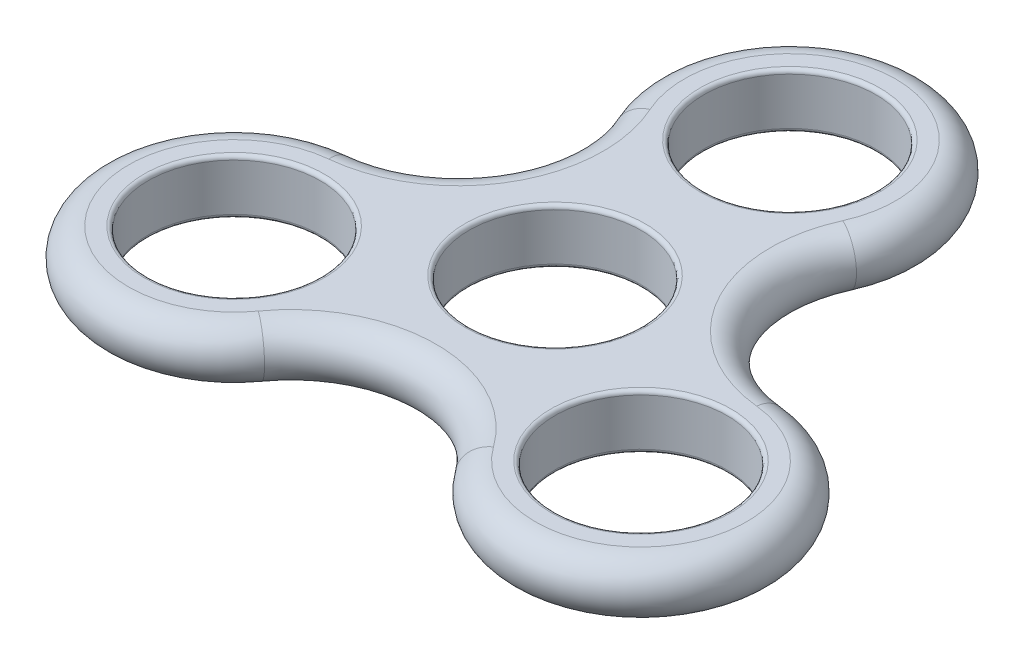
ISO-10303-21;
HEADER;
FILE_DESCRIPTION(('STEP AP214'),'2;1');
FILE_NAME('part.step','',(''),(''),'','','');
FILE_SCHEMA(('AUTOMOTIVE_DESIGN { 1 0 10303 214 1 1 1 1 }'));
ENDSEC;
DATA;
#1=APPLICATION_CONTEXT('core data for automotive mechanical design processes');
#2=APPLICATION_PROTOCOL_DEFINITION('international standard','automotive_design',2000,#1);
#3=PRODUCT_CONTEXT('',#1,'mechanical');
#4=PRODUCT('Part','Part','',(#3));
#5=PRODUCT_RELATED_PRODUCT_CATEGORY('part','',(#4));
#6=PRODUCT_DEFINITION_FORMATION('','',#4);
#7=PRODUCT_DEFINITION_CONTEXT('part definition',#1,'design');
#8=PRODUCT_DEFINITION('design','',#6,#7);
#9=PRODUCT_DEFINITION_SHAPE('','',#8);
#10=(LENGTH_UNIT() NAMED_UNIT(*) SI_UNIT(.MILLI.,.METRE.));
#11=(NAMED_UNIT(*) PLANE_ANGLE_UNIT() SI_UNIT($,.RADIAN.));
#12=(NAMED_UNIT(*) SI_UNIT($,.STERADIAN.) SOLID_ANGLE_UNIT());
#13=UNCERTAINTY_MEASURE_WITH_UNIT(LENGTH_MEASURE(1.E-05),#10,'distance_accuracy_value','');
#14=(GEOMETRIC_REPRESENTATION_CONTEXT(3) GLOBAL_UNCERTAINTY_ASSIGNED_CONTEXT((#13)) GLOBAL_UNIT_ASSIGNED_CONTEXT((#10,
#11,#12)) REPRESENTATION_CONTEXT('',''));
#15=CARTESIAN_POINT('',(0.,0.,0.));
#16=DIRECTION('',(0.,0.,1.));
#17=DIRECTION('',(1.,0.,0.));
#18=AXIS2_PLACEMENT_3D('',#15,#16,#17);
#19=CARTESIAN_POINT('',(0.,3.5,-30.));
#20=DIRECTION('',(0.,1.,0.));
#21=DIRECTION('',(0.,0.,1.));
#22=AXIS2_PLACEMENT_3D('',#19,#20,#21);
#23=TOROIDAL_SURFACE('',#22,13.5,3.5);
#24=CARTESIAN_POINT('',(-12.3057017201798,3.5,-24.4484502007131));
#25=DIRECTION('',(0.411225911058291,0.,0.911533460754063));
#26=DIRECTION('',(0.911533460754063,0.,-0.411225911058291));
#27=AXIS2_PLACEMENT_3D('',#24,#25,#26);
#28=CIRCLE('',#27,3.5);
#29=CARTESIAN_POINT('',(-12.3057017201799,7.,-24.4484502007131));
#30=VERTEX_POINT('',#29);
#31=CARTESIAN_POINT('',(-12.3057017201799,0.,-24.4484502007131));
#32=VERTEX_POINT('',#31);
#33=EDGE_CURVE('E101',#30,#32,#28,.T.);
#34=ORIENTED_EDGE('',*,*,#33,.F.);
#35=CARTESIAN_POINT('',(0.,7.,-30.));
#36=DIRECTION('',(0.,1.,0.));
#37=DIRECTION('',(0.,0.,1.));
#38=AXIS2_PLACEMENT_3D('',#35,#36,#37);
#39=CIRCLE('',#38,13.5);
#40=CARTESIAN_POINT('',(12.3057017201799,7.,-24.4484502007131));
#41=VERTEX_POINT('',#40);
#42=EDGE_CURVE('E109',#41,#30,#39,.T.);
#43=ORIENTED_EDGE('',*,*,#42,.F.);
#44=CARTESIAN_POINT('',(12.3057017201799,3.5,-24.4484502007131));
#45=DIRECTION('',(0.411225911058292,0.,-0.911533460754062));
#46=DIRECTION('',(-0.911533460754062,0.,-0.411225911058293));
#47=AXIS2_PLACEMENT_3D('',#44,#45,#46);
#48=CIRCLE('',#47,3.5);
#49=CARTESIAN_POINT('',(12.3057017201799,0.,-24.4484502007131));
#50=VERTEX_POINT('',#49);
#51=EDGE_CURVE('E91',#41,#50,#48,.T.);
#52=ORIENTED_EDGE('',*,*,#51,.T.);
#53=CARTESIAN_POINT('',(0.,0.,-30.));
#54=DIRECTION('',(0.,1.,0.));
#55=DIRECTION('',(0.,0.,1.));
#56=AXIS2_PLACEMENT_3D('',#53,#54,#55);
#57=CIRCLE('',#56,13.5);
#58=EDGE_CURVE('E125',#32,#50,#57,.F.);
#59=ORIENTED_EDGE('',*,*,#58,.F.);
#60=EDGE_LOOP('',(#34,#43,#52,#59));
#61=FACE_BOUND('',#60,.T.);
#62=ADVANCED_FACE('F37',(#61),#23,.T.);
#63=CARTESIAN_POINT('',(29.16907074413,3.5,-16.8407708461347));
#64=DIRECTION('',(0.,-1.,0.));
#65=DIRECTION('',(0.,0.,-1.));
#66=AXIS2_PLACEMENT_3D('',#63,#64,#65);
#67=TOROIDAL_SURFACE('',#66,18.5,3.5);
#68=ORIENTED_EDGE('',*,*,#51,.F.);
#69=CARTESIAN_POINT('',(29.16907074413,7.,-16.8407708461347));
#70=DIRECTION('',(0.,1.,0.));
#71=DIRECTION('',(0.,0.,1.));
#72=AXIS2_PLACEMENT_3D('',#69,#70,#71);
#73=CIRCLE('',#72,18.5);
#74=CARTESIAN_POINT('',(27.3258298170662,7.,1.56717479928705));
#75=VERTEX_POINT('',#74);
#76=EDGE_CURVE('E94',#75,#41,#73,.F.);
#77=ORIENTED_EDGE('',*,*,#76,.F.);
#78=CARTESIAN_POINT('',(27.3258298170662,3.5,1.56717479928705));
#79=DIRECTION('',(-0.995024088941709,0.,-0.0996346447061538));
#80=DIRECTION('',(-0.0996346447061538,0.,0.995024088941709));
#81=AXIS2_PLACEMENT_3D('',#78,#79,#80);
#82=CIRCLE('',#81,3.5);
#83=CARTESIAN_POINT('',(27.3258298170662,0.,1.56717479928705));
#84=VERTEX_POINT('',#83);
#85=EDGE_CURVE('E102',#75,#84,#82,.T.);
#86=ORIENTED_EDGE('',*,*,#85,.T.);
#87=CARTESIAN_POINT('',(29.16907074413,0.,-16.8407708461347));
#88=DIRECTION('',(0.,1.,0.));
#89=DIRECTION('',(0.,0.,1.));
#90=AXIS2_PLACEMENT_3D('',#87,#88,#89);
#91=CIRCLE('',#90,18.5);
#92=EDGE_CURVE('E96',#50,#84,#91,.T.);
#93=ORIENTED_EDGE('',*,*,#92,.F.);
#94=EDGE_LOOP('',(#68,#77,#86,#93));
#95=FACE_BOUND('',#94,.T.);
#96=ADVANCED_FACE('F93',(#95),#67,.T.);
#97=CARTESIAN_POINT('',(25.9807621135331,3.5,15.0000000000001));
#98=DIRECTION('',(0.,1.,0.));
#99=DIRECTION('',(0.,0.,1.));
#100=AXIS2_PLACEMENT_3D('',#97,#98,#99);
#101=TOROIDAL_SURFACE('',#100,13.5,3.5);
#102=ORIENTED_EDGE('',*,*,#85,.F.);
#103=CARTESIAN_POINT('',(25.9807621135331,7.,15.0000000000001));
#104=DIRECTION('',(0.,1.,0.));
#105=DIRECTION('',(0.,0.,1.));
#106=AXIS2_PLACEMENT_3D('',#103,#104,#105);
#107=CIRCLE('',#106,13.5);
#108=CARTESIAN_POINT('',(15.0201280968863,7.,22.8812754014263));
#109=VERTEX_POINT('',#108);
#110=EDGE_CURVE('E112',#109,#75,#107,.T.);
#111=ORIENTED_EDGE('',*,*,#110,.F.);
#112=CARTESIAN_POINT('',(15.0201280968863,3.5,22.8812754014263));
#113=DIRECTION('',(0.583798177883418,0.,0.811898816047912));
#114=DIRECTION('',(0.811898816047912,0.,-0.583798177883418));
#115=AXIS2_PLACEMENT_3D('',#112,#113,#114);
#116=CIRCLE('',#115,3.5);
#117=CARTESIAN_POINT('',(15.0201280968863,0.,22.8812754014263));
#118=VERTEX_POINT('',#117);
#119=EDGE_CURVE('E142',#109,#118,#116,.T.);
#120=ORIENTED_EDGE('',*,*,#119,.T.);
#121=CARTESIAN_POINT('',(25.9807621135331,0.,15.0000000000001));
#122=DIRECTION('',(0.,1.,0.));
#123=DIRECTION('',(0.,0.,1.));
#124=AXIS2_PLACEMENT_3D('',#121,#122,#123);
#125=CIRCLE('',#124,13.5);
#126=EDGE_CURVE('E128',#84,#118,#125,.F.);
#127=ORIENTED_EDGE('',*,*,#126,.F.);
#128=EDGE_LOOP('',(#102,#111,#120,#127));
#129=FACE_BOUND('',#128,.T.);
#130=ADVANCED_FACE('F206',(#129),#101,.T.);
#131=CARTESIAN_POINT('',(0.,3.5,33.6815416922694));
#132=DIRECTION('',(0.,-1.,0.));
#133=DIRECTION('',(0.,0.,-1.));
#134=AXIS2_PLACEMENT_3D('',#131,#132,#133);
#135=TOROIDAL_SURFACE('',#134,18.5,3.5);
#136=ORIENTED_EDGE('',*,*,#119,.F.);
#137=CARTESIAN_POINT('',(0.,7.,33.6815416922694));
#138=DIRECTION('',(0.,1.,0.));
#139=DIRECTION('',(0.,0.,1.));
#140=AXIS2_PLACEMENT_3D('',#137,#138,#139);
#141=CIRCLE('',#140,18.5);
#142=CARTESIAN_POINT('',(-15.0201280968865,7.,22.8812754014259));
#143=VERTEX_POINT('',#142);
#144=EDGE_CURVE('E118',#143,#109,#141,.F.);
#145=ORIENTED_EDGE('',*,*,#144,.F.);
#146=CARTESIAN_POINT('',(-15.0201280968865,3.5,22.881275401426));
#147=DIRECTION('',(0.583798177883421,0.,-0.81189881604791));
#148=DIRECTION('',(-0.81189881604791,0.,-0.583798177883421));
#149=AXIS2_PLACEMENT_3D('',#146,#147,#148);
#150=CIRCLE('',#149,3.5);
#151=CARTESIAN_POINT('',(-15.0201280968865,0.,22.8812754014259));
#152=VERTEX_POINT('',#151);
#153=EDGE_CURVE('E60',#143,#152,#150,.T.);
#154=ORIENTED_EDGE('',*,*,#153,.T.);
#155=CARTESIAN_POINT('',(0.,0.,33.6815416922694));
#156=DIRECTION('',(0.,1.,0.));
#157=DIRECTION('',(0.,0.,1.));
#158=AXIS2_PLACEMENT_3D('',#155,#156,#157);
#159=CIRCLE('',#158,18.5);
#160=EDGE_CURVE('E131',#118,#152,#159,.T.);
#161=ORIENTED_EDGE('',*,*,#160,.F.);
#162=EDGE_LOOP('',(#136,#145,#154,#161));
#163=FACE_BOUND('',#162,.T.);
#164=ADVANCED_FACE('F279',(#163),#135,.T.);
#165=CARTESIAN_POINT('',(-25.9807621135333,3.5,14.9999999999998));
#166=DIRECTION('',(0.,1.,0.));
#167=DIRECTION('',(0.,0.,1.));
#168=AXIS2_PLACEMENT_3D('',#165,#166,#167);
#169=TOROIDAL_SURFACE('',#168,13.5,3.5);
#170=ORIENTED_EDGE('',*,*,#153,.F.);
#171=CARTESIAN_POINT('',(-25.9807621135333,7.,14.9999999999998));
#172=DIRECTION('',(0.,1.,0.));
#173=DIRECTION('',(0.,0.,1.));
#174=AXIS2_PLACEMENT_3D('',#171,#172,#173);
#175=CIRCLE('',#174,13.5);
#176=CARTESIAN_POINT('',(-27.3258298170663,7.,1.56717479928667));
#177=VERTEX_POINT('',#176);
#178=EDGE_CURVE('E120',#177,#143,#175,.T.);
#179=ORIENTED_EDGE('',*,*,#178,.F.);
#180=CARTESIAN_POINT('',(-27.3258298170663,3.5,1.56717479928667));
#181=DIRECTION('',(-0.99502408894171,0.,0.0996346447061479));
#182=DIRECTION('',(0.0996346447061479,0.,0.99502408894171));
#183=AXIS2_PLACEMENT_3D('',#180,#181,#182);
#184=CIRCLE('',#183,3.5);
#185=CARTESIAN_POINT('',(-27.3258298170663,0.,1.56717479928667));
#186=VERTEX_POINT('',#185);
#187=EDGE_CURVE('E52',#177,#186,#184,.T.);
#188=ORIENTED_EDGE('',*,*,#187,.T.);
#189=CARTESIAN_POINT('',(-25.9807621135333,0.,14.9999999999998));
#190=DIRECTION('',(0.,1.,0.));
#191=DIRECTION('',(0.,0.,1.));
#192=AXIS2_PLACEMENT_3D('',#189,#190,#191);
#193=CIRCLE('',#192,13.5);
#194=EDGE_CURVE('E134',#152,#186,#193,.F.);
#195=ORIENTED_EDGE('',*,*,#194,.F.);
#196=EDGE_LOOP('',(#170,#179,#188,#195));
#197=FACE_BOUND('',#196,.T.);
#198=ADVANCED_FACE('F272',(#197),#169,.T.);
#199=CARTESIAN_POINT('',(-29.16907074413,3.5,-16.8407708461347));
#200=DIRECTION('',(0.,-1.,0.));
#201=DIRECTION('',(0.,0.,-1.));
#202=AXIS2_PLACEMENT_3D('',#199,#200,#201);
#203=TOROIDAL_SURFACE('',#202,18.5,3.5);
#204=CARTESIAN_POINT('',(-29.16907074413,7.,-16.8407708461347));
#205=DIRECTION('',(0.,1.,0.));
#206=DIRECTION('',(0.,0.,1.));
#207=AXIS2_PLACEMENT_3D('',#204,#205,#206);
#208=CIRCLE('',#207,18.5);
#209=EDGE_CURVE('E123',#30,#177,#208,.F.);
#210=ORIENTED_EDGE('',*,*,#209,.F.);
#211=ORIENTED_EDGE('',*,*,#33,.T.);
#212=CARTESIAN_POINT('',(-29.16907074413,0.,-16.8407708461347));
#213=DIRECTION('',(0.,1.,0.));
#214=DIRECTION('',(0.,0.,1.));
#215=AXIS2_PLACEMENT_3D('',#212,#213,#214);
#216=CIRCLE('',#215,18.5);
#217=EDGE_CURVE('E137',#186,#32,#216,.T.);
#218=ORIENTED_EDGE('',*,*,#217,.F.);
#219=ORIENTED_EDGE('',*,*,#187,.F.);
#220=EDGE_LOOP('',(#210,#211,#218,#219));
#221=FACE_BOUND('',#220,.T.);
#222=ADVANCED_FACE('F261',(#221),#203,.T.);
#223=CARTESIAN_POINT('',(25.9807621135331,7.,15.0000000000001));
#224=DIRECTION('',(0.,-1.,0.));
#225=DIRECTION('',(0.,0.,-1.));
#226=AXIS2_PLACEMENT_3D('',#223,#224,#225);
#227=CYLINDRICAL_SURFACE('',#226,11.);
#228=CARTESIAN_POINT('',(25.9807621135331,0.5,15.0000000000001));
#229=DIRECTION('',(0.,1.,0.));
#230=DIRECTION('',(0.,0.,1.));
#231=AXIS2_PLACEMENT_3D('',#228,#229,#230);
#232=CIRCLE('',#231,11.);
#233=CARTESIAN_POINT('',(25.9807621135331,0.5,26.0000000000001));
#234=VERTEX_POINT('',#233);
#235=EDGE_CURVE('E161',#234,#234,#232,.F.);
#236=ORIENTED_EDGE('',*,*,#235,.T.);
#237=EDGE_LOOP('',(#236));
#238=FACE_BOUND('',#237,.T.);
#239=CARTESIAN_POINT('',(25.9807621135331,6.5,15.0000000000001));
#240=DIRECTION('',(0.,1.,0.));
#241=DIRECTION('',(0.,0.,1.));
#242=AXIS2_PLACEMENT_3D('',#239,#240,#241);
#243=CIRCLE('',#242,11.);
#244=CARTESIAN_POINT('',(25.9807621135331,6.5,26.0000000000001));
#245=VERTEX_POINT('',#244);
#246=EDGE_CURVE('E158',#245,#245,#243,.T.);
#247=ORIENTED_EDGE('',*,*,#246,.T.);
#248=EDGE_LOOP('',(#247));
#249=FACE_BOUND('',#248,.T.);
#250=ADVANCED_FACE('F258',(#238,#249),#227,.F.);
#251=CARTESIAN_POINT('',(0.,7.,0.));
#252=DIRECTION('',(0.,-1.,0.));
#253=DIRECTION('',(0.,0.,-1.));
#254=AXIS2_PLACEMENT_3D('',#251,#252,#253);
#255=CYLINDRICAL_SURFACE('',#254,11.);
#256=CARTESIAN_POINT('',(0.,0.5,0.));
#257=DIRECTION('',(0.,1.,0.));
#258=DIRECTION('',(0.,0.,1.));
#259=AXIS2_PLACEMENT_3D('',#256,#257,#258);
#260=CIRCLE('',#259,11.);
#261=CARTESIAN_POINT('',(0.,0.5,11.));
#262=VERTEX_POINT('',#261);
#263=EDGE_CURVE('E179',#262,#262,#260,.F.);
#264=ORIENTED_EDGE('',*,*,#263,.T.);
#265=EDGE_LOOP('',(#264));
#266=FACE_BOUND('',#265,.T.);
#267=CARTESIAN_POINT('',(0.,6.5,0.));
#268=DIRECTION('',(0.,1.,0.));
#269=DIRECTION('',(0.,0.,1.));
#270=AXIS2_PLACEMENT_3D('',#267,#268,#269);
#271=CIRCLE('',#270,11.);
#272=CARTESIAN_POINT('',(0.,6.5,11.));
#273=VERTEX_POINT('',#272);
#274=EDGE_CURVE('E176',#273,#273,#271,.T.);
#275=ORIENTED_EDGE('',*,*,#274,.T.);
#276=EDGE_LOOP('',(#275));
#277=FACE_BOUND('',#276,.T.);
#278=ADVANCED_FACE('F253',(#266,#277),#255,.F.);
#279=CARTESIAN_POINT('',(0.,7.,-30.));
#280=DIRECTION('',(0.,-1.,0.));
#281=DIRECTION('',(0.,0.,-1.));
#282=AXIS2_PLACEMENT_3D('',#279,#280,#281);
#283=CYLINDRICAL_SURFACE('',#282,11.);
#284=CARTESIAN_POINT('',(0.,0.5,-30.));
#285=DIRECTION('',(0.,1.,0.));
#286=DIRECTION('',(0.,0.,1.));
#287=AXIS2_PLACEMENT_3D('',#284,#285,#286);
#288=CIRCLE('',#287,11.);
#289=CARTESIAN_POINT('',(0.,0.5,-19.));
#290=VERTEX_POINT('',#289);
#291=EDGE_CURVE('E11',#290,#290,#288,.F.);
#292=ORIENTED_EDGE('',*,*,#291,.T.);
#293=EDGE_LOOP('',(#292));
#294=FACE_BOUND('',#293,.T.);
#295=CARTESIAN_POINT('',(0.,6.5,-30.));
#296=DIRECTION('',(0.,1.,0.));
#297=DIRECTION('',(0.,0.,1.));
#298=AXIS2_PLACEMENT_3D('',#295,#296,#297);
#299=CIRCLE('',#298,11.);
#300=CARTESIAN_POINT('',(0.,6.5,-19.));
#301=VERTEX_POINT('',#300);
#302=EDGE_CURVE('E45',#301,#301,#299,.T.);
#303=ORIENTED_EDGE('',*,*,#302,.T.);
#304=EDGE_LOOP('',(#303));
#305=FACE_BOUND('',#304,.T.);
#306=ADVANCED_FACE('F190',(#294,#305),#283,.F.);
#307=CARTESIAN_POINT('',(-25.9807621135333,7.,14.9999999999998));
#308=DIRECTION('',(0.,-1.,0.));
#309=DIRECTION('',(0.,0.,-1.));
#310=AXIS2_PLACEMENT_3D('',#307,#308,#309);
#311=CYLINDRICAL_SURFACE('',#310,11.);
#312=CARTESIAN_POINT('',(-25.9807621135333,0.5,14.9999999999998));
#313=DIRECTION('',(0.,1.,0.));
#314=DIRECTION('',(0.,0.,1.));
#315=AXIS2_PLACEMENT_3D('',#312,#313,#314);
#316=CIRCLE('',#315,11.);
#317=CARTESIAN_POINT('',(-25.9807621135333,0.5,25.9999999999998));
#318=VERTEX_POINT('',#317);
#319=EDGE_CURVE('E185',#318,#318,#316,.F.);
#320=ORIENTED_EDGE('',*,*,#319,.T.);
#321=EDGE_LOOP('',(#320));
#322=FACE_BOUND('',#321,.T.);
#323=CARTESIAN_POINT('',(-25.9807621135333,6.5,14.9999999999998));
#324=DIRECTION('',(0.,1.,0.));
#325=DIRECTION('',(0.,0.,1.));
#326=AXIS2_PLACEMENT_3D('',#323,#324,#325);
#327=CIRCLE('',#326,11.);
#328=CARTESIAN_POINT('',(-25.9807621135333,6.5,25.9999999999998));
#329=VERTEX_POINT('',#328);
#330=EDGE_CURVE('E182',#329,#329,#327,.T.);
#331=ORIENTED_EDGE('',*,*,#330,.T.);
#332=EDGE_LOOP('',(#331));
#333=FACE_BOUND('',#332,.T.);
#334=ADVANCED_FACE('F243',(#322,#333),#311,.F.);
#335=CARTESIAN_POINT('',(0.,7.,0.));
#336=DIRECTION('',(0.,1.,0.));
#337=DIRECTION('',(0.,0.,1.));
#338=AXIS2_PLACEMENT_3D('',#335,#336,#337);
#339=PLANE('',#338);
#340=CARTESIAN_POINT('',(25.9807621135331,7.,15.0000000000001));
#341=DIRECTION('',(0.,1.,0.));
#342=DIRECTION('',(0.,0.,1.));
#343=AXIS2_PLACEMENT_3D('',#340,#341,#342);
#344=CIRCLE('',#343,11.5);
#345=CARTESIAN_POINT('',(25.9807621135331,7.,26.5000000000001));
#346=VERTEX_POINT('',#345);
#347=EDGE_CURVE('E173',#346,#346,#344,.F.);
#348=ORIENTED_EDGE('',*,*,#347,.T.);
#349=EDGE_LOOP('',(#348));
#350=FACE_BOUND('',#349,.T.);
#351=CARTESIAN_POINT('',(0.,7.,0.));
#352=DIRECTION('',(0.,1.,0.));
#353=DIRECTION('',(0.,0.,1.));
#354=AXIS2_PLACEMENT_3D('',#351,#352,#353);
#355=CIRCLE('',#354,11.5);
#356=CARTESIAN_POINT('',(0.,7.,11.5));
#357=VERTEX_POINT('',#356);
#358=EDGE_CURVE('E170',#357,#357,#355,.F.);
#359=ORIENTED_EDGE('',*,*,#358,.T.);
#360=EDGE_LOOP('',(#359));
#361=FACE_BOUND('',#360,.T.);
#362=CARTESIAN_POINT('',(-25.9807621135333,7.,14.9999999999998));
#363=DIRECTION('',(0.,1.,0.));
#364=DIRECTION('',(0.,0.,1.));
#365=AXIS2_PLACEMENT_3D('',#362,#363,#364);
#366=CIRCLE('',#365,11.5);
#367=CARTESIAN_POINT('',(-25.9807621135333,7.,26.4999999999998));
#368=VERTEX_POINT('',#367);
#369=EDGE_CURVE('E167',#368,#368,#366,.F.);
#370=ORIENTED_EDGE('',*,*,#369,.T.);
#371=EDGE_LOOP('',(#370));
#372=FACE_BOUND('',#371,.T.);
#373=CARTESIAN_POINT('',(0.,7.,-30.));
#374=DIRECTION('',(0.,1.,0.));
#375=DIRECTION('',(0.,0.,1.));
#376=AXIS2_PLACEMENT_3D('',#373,#374,#375);
#377=CIRCLE('',#376,11.5);
#378=CARTESIAN_POINT('',(0.,7.,-18.5));
#379=VERTEX_POINT('',#378);
#380=EDGE_CURVE('E164',#379,#379,#377,.F.);
#381=ORIENTED_EDGE('',*,*,#380,.T.);
#382=EDGE_LOOP('',(#381));
#383=FACE_BOUND('',#382,.T.);
#384=ORIENTED_EDGE('',*,*,#42,.T.);
#385=ORIENTED_EDGE('',*,*,#209,.T.);
#386=ORIENTED_EDGE('',*,*,#178,.T.);
#387=ORIENTED_EDGE('',*,*,#144,.T.);
#388=ORIENTED_EDGE('',*,*,#110,.T.);
#389=ORIENTED_EDGE('',*,*,#76,.T.);
#390=EDGE_LOOP('',(#384,#385,#386,#387,#388,#389));
#391=FACE_BOUND('',#390,.T.);
#392=ADVANCED_FACE('F107',(#350,#361,#372,#383,#391),#339,.T.);
#393=CARTESIAN_POINT('',(0.,0.,0.));
#394=DIRECTION('',(0.,1.,0.));
#395=DIRECTION('',(0.,0.,1.));
#396=AXIS2_PLACEMENT_3D('',#393,#394,#395);
#397=PLANE('',#396);
#398=CARTESIAN_POINT('',(25.9807621135331,0.,15.0000000000001));
#399=DIRECTION('',(0.,1.,0.));
#400=DIRECTION('',(0.,0.,1.));
#401=AXIS2_PLACEMENT_3D('',#398,#399,#400);
#402=CIRCLE('',#401,11.5);
#403=CARTESIAN_POINT('',(25.9807621135331,0.,26.5000000000001));
#404=VERTEX_POINT('',#403);
#405=EDGE_CURVE('E155',#404,#404,#402,.T.);
#406=ORIENTED_EDGE('',*,*,#405,.T.);
#407=EDGE_LOOP('',(#406));
#408=FACE_BOUND('',#407,.T.);
#409=CARTESIAN_POINT('',(0.,0.,0.));
#410=DIRECTION('',(0.,1.,0.));
#411=DIRECTION('',(0.,0.,1.));
#412=AXIS2_PLACEMENT_3D('',#409,#410,#411);
#413=CIRCLE('',#412,11.5);
#414=CARTESIAN_POINT('',(0.,0.,11.5));
#415=VERTEX_POINT('',#414);
#416=EDGE_CURVE('E152',#415,#415,#413,.T.);
#417=ORIENTED_EDGE('',*,*,#416,.T.);
#418=EDGE_LOOP('',(#417));
#419=FACE_BOUND('',#418,.T.);
#420=CARTESIAN_POINT('',(-25.9807621135333,0.,14.9999999999998));
#421=DIRECTION('',(0.,1.,0.));
#422=DIRECTION('',(0.,0.,1.));
#423=AXIS2_PLACEMENT_3D('',#420,#421,#422);
#424=CIRCLE('',#423,11.5);
#425=CARTESIAN_POINT('',(-25.9807621135333,0.,26.4999999999998));
#426=VERTEX_POINT('',#425);
#427=EDGE_CURVE('E149',#426,#426,#424,.T.);
#428=ORIENTED_EDGE('',*,*,#427,.T.);
#429=EDGE_LOOP('',(#428));
#430=FACE_BOUND('',#429,.T.);
#431=CARTESIAN_POINT('',(0.,0.,-30.));
#432=DIRECTION('',(0.,1.,0.));
#433=DIRECTION('',(0.,0.,1.));
#434=AXIS2_PLACEMENT_3D('',#431,#432,#433);
#435=CIRCLE('',#434,11.5);
#436=CARTESIAN_POINT('',(0.,0.,-18.5));
#437=VERTEX_POINT('',#436);
#438=EDGE_CURVE('E146',#437,#437,#435,.T.);
#439=ORIENTED_EDGE('',*,*,#438,.T.);
#440=EDGE_LOOP('',(#439));
#441=FACE_BOUND('',#440,.T.);
#442=ORIENTED_EDGE('',*,*,#194,.T.);
#443=ORIENTED_EDGE('',*,*,#217,.T.);
#444=ORIENTED_EDGE('',*,*,#58,.T.);
#445=ORIENTED_EDGE('',*,*,#92,.T.);
#446=ORIENTED_EDGE('',*,*,#126,.T.);
#447=ORIENTED_EDGE('',*,*,#160,.T.);
#448=EDGE_LOOP('',(#442,#443,#444,#445,#446,#447));
#449=FACE_BOUND('',#448,.T.);
#450=ADVANCED_FACE('F218',(#408,#419,#430,#441,#449),#397,.F.);
#451=CARTESIAN_POINT('',(25.9807621135331,0.5,15.0000000000001));
#452=DIRECTION('',(0.,1.,0.));
#453=DIRECTION('',(0.,0.,1.));
#454=AXIS2_PLACEMENT_3D('',#451,#452,#453);
#455=TOROIDAL_SURFACE('',#454,11.5,0.5);
#456=ORIENTED_EDGE('',*,*,#235,.F.);
#457=EDGE_LOOP('',(#456));
#458=FACE_BOUND('',#457,.T.);
#459=ORIENTED_EDGE('',*,*,#405,.F.);
#460=EDGE_LOOP('',(#459));
#461=FACE_BOUND('',#460,.T.);
#462=ADVANCED_FACE('F214',(#458,#461),#455,.T.);
#463=CARTESIAN_POINT('',(25.9807621135331,6.5,15.0000000000001));
#464=DIRECTION('',(0.,1.,0.));
#465=DIRECTION('',(0.,0.,1.));
#466=AXIS2_PLACEMENT_3D('',#463,#464,#465);
#467=TOROIDAL_SURFACE('',#466,11.5,0.5);
#468=ORIENTED_EDGE('',*,*,#347,.F.);
#469=EDGE_LOOP('',(#468));
#470=FACE_BOUND('',#469,.T.);
#471=ORIENTED_EDGE('',*,*,#246,.F.);
#472=EDGE_LOOP('',(#471));
#473=FACE_BOUND('',#472,.T.);
#474=ADVANCED_FACE('F217',(#470,#473),#467,.T.);
#475=CARTESIAN_POINT('',(0.,0.5,0.));
#476=DIRECTION('',(0.,1.,0.));
#477=DIRECTION('',(0.,0.,1.));
#478=AXIS2_PLACEMENT_3D('',#475,#476,#477);
#479=TOROIDAL_SURFACE('',#478,11.5,0.5);
#480=ORIENTED_EDGE('',*,*,#263,.F.);
#481=EDGE_LOOP('',(#480));
#482=FACE_BOUND('',#481,.T.);
#483=ORIENTED_EDGE('',*,*,#416,.F.);
#484=EDGE_LOOP('',(#483));
#485=FACE_BOUND('',#484,.T.);
#486=ADVANCED_FACE('F222',(#482,#485),#479,.T.);
#487=CARTESIAN_POINT('',(0.,6.5,0.));
#488=DIRECTION('',(0.,1.,0.));
#489=DIRECTION('',(0.,0.,1.));
#490=AXIS2_PLACEMENT_3D('',#487,#488,#489);
#491=TOROIDAL_SURFACE('',#490,11.5,0.5);
#492=ORIENTED_EDGE('',*,*,#358,.F.);
#493=EDGE_LOOP('',(#492));
#494=FACE_BOUND('',#493,.T.);
#495=ORIENTED_EDGE('',*,*,#274,.F.);
#496=EDGE_LOOP('',(#495));
#497=FACE_BOUND('',#496,.T.);
#498=ADVANCED_FACE('F226',(#494,#497),#491,.T.);
#499=CARTESIAN_POINT('',(-25.9807621135333,0.5,14.9999999999998));
#500=DIRECTION('',(0.,1.,0.));
#501=DIRECTION('',(0.,0.,1.));
#502=AXIS2_PLACEMENT_3D('',#499,#500,#501);
#503=TOROIDAL_SURFACE('',#502,11.5,0.5);
#504=ORIENTED_EDGE('',*,*,#319,.F.);
#505=EDGE_LOOP('',(#504));
#506=FACE_BOUND('',#505,.T.);
#507=ORIENTED_EDGE('',*,*,#427,.F.);
#508=EDGE_LOOP('',(#507));
#509=FACE_BOUND('',#508,.T.);
#510=ADVANCED_FACE('F230',(#506,#509),#503,.T.);
#511=CARTESIAN_POINT('',(-25.9807621135333,6.5,14.9999999999998));
#512=DIRECTION('',(0.,1.,0.));
#513=DIRECTION('',(0.,0.,1.));
#514=AXIS2_PLACEMENT_3D('',#511,#512,#513);
#515=TOROIDAL_SURFACE('',#514,11.5,0.5);
#516=ORIENTED_EDGE('',*,*,#369,.F.);
#517=EDGE_LOOP('',(#516));
#518=FACE_BOUND('',#517,.T.);
#519=ORIENTED_EDGE('',*,*,#330,.F.);
#520=EDGE_LOOP('',(#519));
#521=FACE_BOUND('',#520,.T.);
#522=ADVANCED_FACE('F198',(#518,#521),#515,.T.);
#523=CARTESIAN_POINT('',(0.,0.5,-30.));
#524=DIRECTION('',(0.,1.,0.));
#525=DIRECTION('',(0.,0.,1.));
#526=AXIS2_PLACEMENT_3D('',#523,#524,#525);
#527=TOROIDAL_SURFACE('',#526,11.5,0.5);
#528=ORIENTED_EDGE('',*,*,#291,.F.);
#529=EDGE_LOOP('',(#528));
#530=FACE_BOUND('',#529,.T.);
#531=ORIENTED_EDGE('',*,*,#438,.F.);
#532=EDGE_LOOP('',(#531));
#533=FACE_BOUND('',#532,.T.);
#534=ADVANCED_FACE('F193',(#530,#533),#527,.T.);
#535=CARTESIAN_POINT('',(0.,6.5,-30.));
#536=DIRECTION('',(0.,1.,0.));
#537=DIRECTION('',(0.,0.,1.));
#538=AXIS2_PLACEMENT_3D('',#535,#536,#537);
#539=TOROIDAL_SURFACE('',#538,11.5,0.5);
#540=ORIENTED_EDGE('',*,*,#380,.F.);
#541=EDGE_LOOP('',(#540));
#542=FACE_BOUND('',#541,.T.);
#543=ORIENTED_EDGE('',*,*,#302,.F.);
#544=EDGE_LOOP('',(#543));
#545=FACE_BOUND('',#544,.T.);
#546=ADVANCED_FACE('F39',(#542,#545),#539,.T.);
#547=CLOSED_SHELL('',(#62,#96,#130,#164,#198,#222,#250,#278,#306,#334,#392,#450,#462,#474,#486,
#498,#510,#522,#534,#546));
#548=MANIFOLD_SOLID_BREP('B2',#547);
#549=ADVANCED_BREP_SHAPE_REPRESENTATION('',(#18,#548),#14);
#550=SHAPE_DEFINITION_REPRESENTATION(#9,#549);
ENDSEC;
END-ISO-10303-21;
